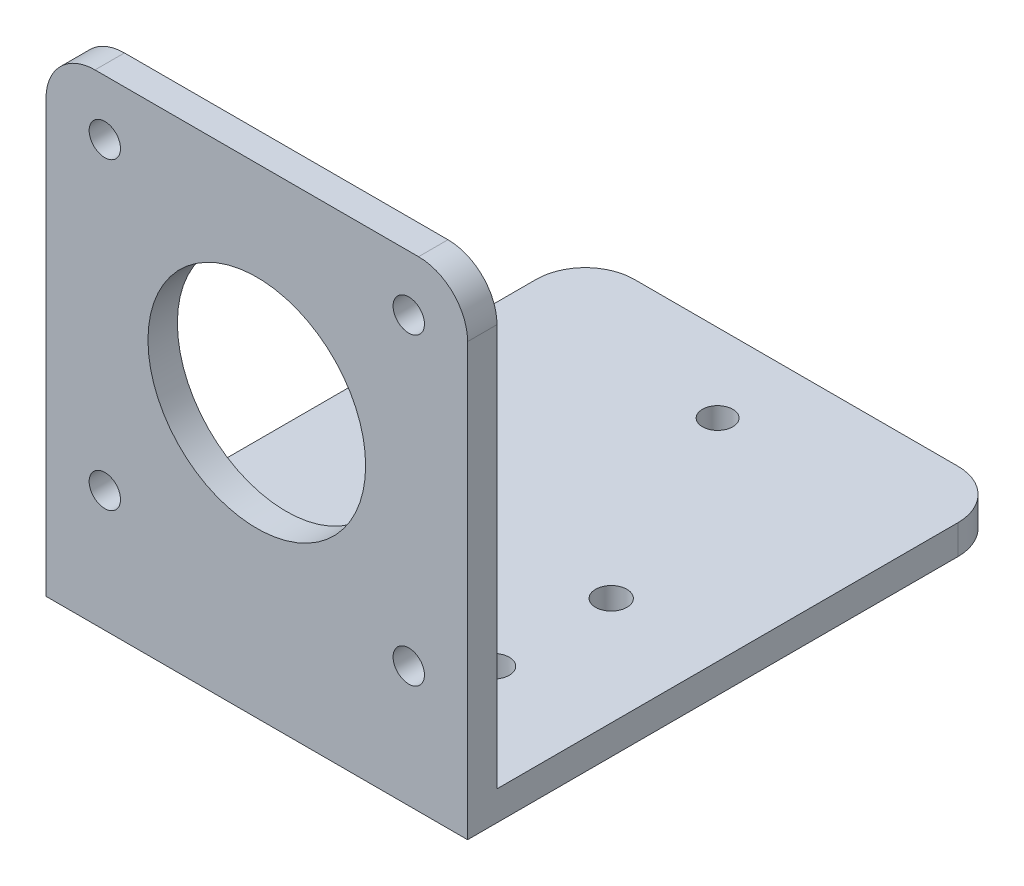
ISO-10303-21;
HEADER;
FILE_DESCRIPTION(('STEP AP214'),'2;1');
FILE_NAME('part.step','',(''),(''),'','','');
FILE_SCHEMA(('AUTOMOTIVE_DESIGN { 1 0 10303 214 1 1 1 1 }'));
ENDSEC;
DATA;
#1=APPLICATION_CONTEXT('core data for automotive mechanical design processes');
#2=APPLICATION_PROTOCOL_DEFINITION('international standard','automotive_design',2000,#1);
#3=PRODUCT_CONTEXT('',#1,'mechanical');
#4=PRODUCT('Part','Part','',(#3));
#5=PRODUCT_RELATED_PRODUCT_CATEGORY('part','',(#4));
#6=PRODUCT_DEFINITION_FORMATION('','',#4);
#7=PRODUCT_DEFINITION_CONTEXT('part definition',#1,'design');
#8=PRODUCT_DEFINITION('design','',#6,#7);
#9=PRODUCT_DEFINITION_SHAPE('','',#8);
#10=(LENGTH_UNIT() NAMED_UNIT(*) SI_UNIT(.MILLI.,.METRE.));
#11=(NAMED_UNIT(*) PLANE_ANGLE_UNIT() SI_UNIT($,.RADIAN.));
#12=(NAMED_UNIT(*) SI_UNIT($,.STERADIAN.) SOLID_ANGLE_UNIT());
#13=UNCERTAINTY_MEASURE_WITH_UNIT(LENGTH_MEASURE(1.E-05),#10,'distance_accuracy_value','');
#14=(GEOMETRIC_REPRESENTATION_CONTEXT(3) GLOBAL_UNCERTAINTY_ASSIGNED_CONTEXT((#13)) GLOBAL_UNIT_ASSIGNED_CONTEXT((#10,
#11,#12)) REPRESENTATION_CONTEXT('',''));
#15=CARTESIAN_POINT('',(0.,0.,0.));
#16=DIRECTION('',(0.,0.,1.));
#17=DIRECTION('',(1.,0.,0.));
#18=AXIS2_PLACEMENT_3D('',#15,#16,#17);
#19=CARTESIAN_POINT('',(0.,0.,0.));
#20=DIRECTION('',(0.,0.,1.));
#21=DIRECTION('',(1.,0.,0.));
#22=AXIS2_PLACEMENT_3D('',#19,#20,#21);
#23=PLANE('',#22);
#24=CARTESIAN_POINT('',(37.,-5.65,0.));
#25=DIRECTION('',(0.,0.,-1.));
#26=DIRECTION('',(-1.,0.,0.));
#27=AXIS2_PLACEMENT_3D('',#24,#25,#26);
#28=CIRCLE('',#27,1.6);
#29=CARTESIAN_POINT('',(35.4,-5.65,0.));
#30=VERTEX_POINT('',#29);
#31=EDGE_CURVE('E165',#30,#30,#28,.T.);
#32=ORIENTED_EDGE('',*,*,#31,.F.);
#33=EDGE_LOOP('',(#32));
#34=FACE_BOUND('',#33,.T.);
#35=CARTESIAN_POINT('',(5.99999999999999,-5.65,0.));
#36=DIRECTION('',(0.,0.,-1.));
#37=DIRECTION('',(1.,0.,0.));
#38=AXIS2_PLACEMENT_3D('',#35,#36,#37);
#39=CIRCLE('',#38,1.6);
#40=CARTESIAN_POINT('',(7.59999999999999,-5.65,0.));
#41=VERTEX_POINT('',#40);
#42=EDGE_CURVE('E161',#41,#41,#39,.T.);
#43=ORIENTED_EDGE('',*,*,#42,.F.);
#44=EDGE_LOOP('',(#43));
#45=FACE_BOUND('',#44,.T.);
#46=CARTESIAN_POINT('',(21.5,-21.15,0.));
#47=DIRECTION('',(0.,0.,-1.));
#48=DIRECTION('',(-1.,0.,0.));
#49=AXIS2_PLACEMENT_3D('',#46,#47,#48);
#50=CIRCLE('',#49,11.1);
#51=CARTESIAN_POINT('',(10.4,-21.15,0.));
#52=VERTEX_POINT('',#51);
#53=EDGE_CURVE('E166',#52,#52,#50,.T.);
#54=ORIENTED_EDGE('',*,*,#53,.F.);
#55=EDGE_LOOP('',(#54));
#56=FACE_BOUND('',#55,.T.);
#57=CARTESIAN_POINT('',(5.99999999999999,-36.65,0.));
#58=DIRECTION('',(0.,0.,-1.));
#59=DIRECTION('',(-1.,0.,0.));
#60=AXIS2_PLACEMENT_3D('',#57,#58,#59);
#61=CIRCLE('',#60,1.59999999999999);
#62=CARTESIAN_POINT('',(4.4,-36.65,0.));
#63=VERTEX_POINT('',#62);
#64=EDGE_CURVE('E170',#63,#63,#61,.T.);
#65=ORIENTED_EDGE('',*,*,#64,.F.);
#66=EDGE_LOOP('',(#65));
#67=FACE_BOUND('',#66,.T.);
#68=CARTESIAN_POINT('',(37.,-36.65,0.));
#69=DIRECTION('',(0.,0.,-1.));
#70=DIRECTION('',(1.,0.,0.));
#71=AXIS2_PLACEMENT_3D('',#68,#69,#70);
#72=CIRCLE('',#71,1.60000000000001);
#73=CARTESIAN_POINT('',(38.6,-36.65,0.));
#74=VERTEX_POINT('',#73);
#75=EDGE_CURVE('E160',#74,#74,#72,.T.);
#76=ORIENTED_EDGE('',*,*,#75,.F.);
#77=EDGE_LOOP('',(#76));
#78=FACE_BOUND('',#77,.T.);
#79=DIRECTION('',(0.,-1.,0.));
#80=VECTOR('',#79,1.);
#81=CARTESIAN_POINT('',(0.,0.,0.));
#82=LINE('',#81,#80);
#83=CARTESIAN_POINT('',(0.,-5.,0.));
#84=VERTEX_POINT('',#83);
#85=CARTESIAN_POINT('',(0.,-46.,0.));
#86=VERTEX_POINT('',#85);
#87=EDGE_CURVE('E140',#84,#86,#82,.T.);
#88=ORIENTED_EDGE('',*,*,#87,.F.);
#89=CARTESIAN_POINT('',(5.,-5.,0.));
#90=DIRECTION('',(0.,0.,1.));
#91=DIRECTION('',(1.,0.,0.));
#92=AXIS2_PLACEMENT_3D('',#89,#90,#91);
#93=CIRCLE('',#92,5.);
#94=CARTESIAN_POINT('',(5.,0.,0.));
#95=VERTEX_POINT('',#94);
#96=EDGE_CURVE('E257',#84,#95,#93,.F.);
#97=ORIENTED_EDGE('',*,*,#96,.T.);
#98=DIRECTION('',(-1.,0.,0.));
#99=VECTOR('',#98,1.);
#100=CARTESIAN_POINT('',(0.,0.,0.));
#101=LINE('',#100,#99);
#102=CARTESIAN_POINT('',(38.,0.,0.));
#103=VERTEX_POINT('',#102);
#104=EDGE_CURVE('E139',#103,#95,#101,.T.);
#105=ORIENTED_EDGE('',*,*,#104,.F.);
#106=CARTESIAN_POINT('',(38.,-5.,0.));
#107=DIRECTION('',(0.,0.,1.));
#108=DIRECTION('',(1.,0.,0.));
#109=AXIS2_PLACEMENT_3D('',#106,#107,#108);
#110=CIRCLE('',#109,5.);
#111=CARTESIAN_POINT('',(43.,-5.,0.));
#112=VERTEX_POINT('',#111);
#113=EDGE_CURVE('E137',#103,#112,#110,.F.);
#114=ORIENTED_EDGE('',*,*,#113,.T.);
#115=DIRECTION('',(0.,1.,0.));
#116=VECTOR('',#115,1.);
#117=CARTESIAN_POINT('',(43.,0.,0.));
#118=LINE('',#117,#116);
#119=CARTESIAN_POINT('',(43.,-46.,0.));
#120=VERTEX_POINT('',#119);
#121=EDGE_CURVE('E121',#120,#112,#118,.T.);
#122=ORIENTED_EDGE('',*,*,#121,.F.);
#123=DIRECTION('',(1.,0.,0.));
#124=VECTOR('',#123,1.);
#125=CARTESIAN_POINT('',(43.,-46.,0.));
#126=LINE('',#125,#124);
#127=EDGE_CURVE('E135',#86,#120,#126,.T.);
#128=ORIENTED_EDGE('',*,*,#127,.F.);
#129=EDGE_LOOP('',(#88,#97,#105,#114,#122,#128));
#130=FACE_BOUND('',#129,.T.);
#131=ADVANCED_FACE('F39',(#34,#45,#56,#67,#78,#130),#23,.F.);
#132=CARTESIAN_POINT('',(0.,0.,3.));
#133=DIRECTION('',(1.,0.,0.));
#134=DIRECTION('',(0.,1.,0.));
#135=AXIS2_PLACEMENT_3D('',#132,#133,#134);
#136=PLANE('',#135);
#137=DIRECTION('',(0.,0.,1.));
#138=VECTOR('',#137,1.);
#139=CARTESIAN_POINT('',(0.,-46.,-52.));
#140=LINE('',#139,#138);
#141=CARTESIAN_POINT('',(0.,-46.,-47.));
#142=VERTEX_POINT('',#141);
#143=EDGE_CURVE('E129',#142,#86,#140,.T.);
#144=ORIENTED_EDGE('',*,*,#143,.F.);
#145=DIRECTION('',(0.,1.,0.));
#146=VECTOR('',#145,1.);
#147=CARTESIAN_POINT('',(0.,0.,-47.));
#148=LINE('',#147,#146);
#149=CARTESIAN_POINT('',(0.,-49.,-47.));
#150=VERTEX_POINT('',#149);
#151=EDGE_CURVE('E252',#142,#150,#148,.F.);
#152=ORIENTED_EDGE('',*,*,#151,.T.);
#153=DIRECTION('',(0.,0.,-1.));
#154=VECTOR('',#153,1.);
#155=CARTESIAN_POINT('',(0.,-49.,3.));
#156=LINE('',#155,#154);
#157=CARTESIAN_POINT('',(0.,-49.,3.));
#158=VERTEX_POINT('',#157);
#159=EDGE_CURVE('E219',#158,#150,#156,.T.);
#160=ORIENTED_EDGE('',*,*,#159,.F.);
#161=DIRECTION('',(0.,-1.,0.));
#162=VECTOR('',#161,1.);
#163=CARTESIAN_POINT('',(0.,0.,3.));
#164=LINE('',#163,#162);
#165=CARTESIAN_POINT('',(0.,-5.,3.));
#166=VERTEX_POINT('',#165);
#167=EDGE_CURVE('E200',#166,#158,#164,.T.);
#168=ORIENTED_EDGE('',*,*,#167,.F.);
#169=DIRECTION('',(0.,0.,-1.));
#170=VECTOR('',#169,1.);
#171=CARTESIAN_POINT('',(0.,-5.,3.));
#172=LINE('',#171,#170);
#173=EDGE_CURVE('E248',#166,#84,#172,.T.);
#174=ORIENTED_EDGE('',*,*,#173,.T.);
#175=ORIENTED_EDGE('',*,*,#87,.T.);
#176=EDGE_LOOP('',(#144,#152,#160,#168,#174,#175));
#177=FACE_BOUND('',#176,.T.);
#178=ADVANCED_FACE('F291',(#177),#136,.F.);
#179=CARTESIAN_POINT('',(0.,-49.,3.));
#180=DIRECTION('',(0.,1.,0.));
#181=DIRECTION('',(0.,0.,1.));
#182=AXIS2_PLACEMENT_3D('',#179,#180,#181);
#183=PLANE('',#182);
#184=CARTESIAN_POINT('',(11.,-49.,-22.65));
#185=DIRECTION('',(0.,1.,0.));
#186=DIRECTION('',(0.,0.,1.));
#187=AXIS2_PLACEMENT_3D('',#184,#185,#186);
#188=CIRCLE('',#187,1.6);
#189=CARTESIAN_POINT('',(11.,-49.,-21.05));
#190=VERTEX_POINT('',#189);
#191=EDGE_CURVE('E147',#190,#190,#188,.T.);
#192=ORIENTED_EDGE('',*,*,#191,.T.);
#193=EDGE_LOOP('',(#192));
#194=FACE_BOUND('',#193,.T.);
#195=CARTESIAN_POINT('',(32.,-49.,-10.65));
#196=DIRECTION('',(0.,1.,0.));
#197=DIRECTION('',(0.,0.,1.));
#198=AXIS2_PLACEMENT_3D('',#195,#196,#197);
#199=CIRCLE('',#198,1.6);
#200=CARTESIAN_POINT('',(32.,-49.,-9.05));
#201=VERTEX_POINT('',#200);
#202=EDGE_CURVE('E154',#201,#201,#199,.T.);
#203=ORIENTED_EDGE('',*,*,#202,.T.);
#204=EDGE_LOOP('',(#203));
#205=FACE_BOUND('',#204,.T.);
#206=CARTESIAN_POINT('',(32.,-49.,-22.65));
#207=DIRECTION('',(0.,1.,0.));
#208=DIRECTION('',(0.,0.,1.));
#209=AXIS2_PLACEMENT_3D('',#206,#207,#208);
#210=CIRCLE('',#209,1.6);
#211=CARTESIAN_POINT('',(32.,-49.,-21.05));
#212=VERTEX_POINT('',#211);
#213=EDGE_CURVE('E333',#212,#212,#210,.T.);
#214=ORIENTED_EDGE('',*,*,#213,.T.);
#215=EDGE_LOOP('',(#214));
#216=FACE_BOUND('',#215,.T.);
#217=CARTESIAN_POINT('',(21.5,-49.,-44.));
#218=DIRECTION('',(0.,1.,0.));
#219=DIRECTION('',(0.,0.,1.));
#220=AXIS2_PLACEMENT_3D('',#217,#218,#219);
#221=CIRCLE('',#220,1.55);
#222=CARTESIAN_POINT('',(21.5,-49.,-42.45));
#223=VERTEX_POINT('',#222);
#224=EDGE_CURVE('E337',#223,#223,#221,.T.);
#225=ORIENTED_EDGE('',*,*,#224,.T.);
#226=EDGE_LOOP('',(#225));
#227=FACE_BOUND('',#226,.T.);
#228=CARTESIAN_POINT('',(11.,-49.,-10.65));
#229=DIRECTION('',(0.,1.,0.));
#230=DIRECTION('',(0.,0.,1.));
#231=AXIS2_PLACEMENT_3D('',#228,#229,#230);
#232=CIRCLE('',#231,1.6);
#233=CARTESIAN_POINT('',(11.,-49.,-9.05));
#234=VERTEX_POINT('',#233);
#235=EDGE_CURVE('E340',#234,#234,#232,.T.);
#236=ORIENTED_EDGE('',*,*,#235,.T.);
#237=EDGE_LOOP('',(#236));
#238=FACE_BOUND('',#237,.T.);
#239=DIRECTION('',(-1.,0.,0.));
#240=VECTOR('',#239,1.);
#241=CARTESIAN_POINT('',(43.,-49.,-52.));
#242=LINE('',#241,#240);
#243=CARTESIAN_POINT('',(38.,-49.,-52.));
#244=VERTEX_POINT('',#243);
#245=CARTESIAN_POINT('',(5.00000000000001,-49.,-52.));
#246=VERTEX_POINT('',#245);
#247=EDGE_CURVE('E146',#244,#246,#242,.T.);
#248=ORIENTED_EDGE('',*,*,#247,.F.);
#249=CARTESIAN_POINT('',(38.,-49.,-47.));
#250=DIRECTION('',(0.,1.,0.));
#251=DIRECTION('',(0.,0.,1.));
#252=AXIS2_PLACEMENT_3D('',#249,#250,#251);
#253=CIRCLE('',#252,5.);
#254=CARTESIAN_POINT('',(43.,-49.,-47.));
#255=VERTEX_POINT('',#254);
#256=EDGE_CURVE('E234',#244,#255,#253,.F.);
#257=ORIENTED_EDGE('',*,*,#256,.T.);
#258=DIRECTION('',(0.,0.,-1.));
#259=VECTOR('',#258,1.);
#260=CARTESIAN_POINT('',(43.,-49.,3.));
#261=LINE('',#260,#259);
#262=CARTESIAN_POINT('',(43.,-49.,3.));
#263=VERTEX_POINT('',#262);
#264=EDGE_CURVE('E212',#263,#255,#261,.T.);
#265=ORIENTED_EDGE('',*,*,#264,.F.);
#266=DIRECTION('',(1.,0.,0.));
#267=VECTOR('',#266,1.);
#268=CARTESIAN_POINT('',(0.,-49.,3.));
#269=LINE('',#268,#267);
#270=EDGE_CURVE('E203',#158,#263,#269,.T.);
#271=ORIENTED_EDGE('',*,*,#270,.F.);
#272=ORIENTED_EDGE('',*,*,#159,.T.);
#273=CARTESIAN_POINT('',(5.00000000000001,-49.,-47.));
#274=DIRECTION('',(0.,1.,0.));
#275=DIRECTION('',(0.,0.,1.));
#276=AXIS2_PLACEMENT_3D('',#273,#274,#275);
#277=CIRCLE('',#276,5.);
#278=EDGE_CURVE('E231',#150,#246,#277,.F.);
#279=ORIENTED_EDGE('',*,*,#278,.T.);
#280=EDGE_LOOP('',(#248,#257,#265,#271,#272,#279));
#281=FACE_BOUND('',#280,.T.);
#282=ADVANCED_FACE('F278',(#194,#205,#216,#227,#238,#281),#183,.F.);
#283=CARTESIAN_POINT('',(43.,0.,3.));
#284=DIRECTION('',(-1.,0.,0.));
#285=DIRECTION('',(0.,-1.,0.));
#286=AXIS2_PLACEMENT_3D('',#283,#284,#285);
#287=PLANE('',#286);
#288=ORIENTED_EDGE('',*,*,#264,.T.);
#289=DIRECTION('',(0.,-1.,0.));
#290=VECTOR('',#289,1.);
#291=CARTESIAN_POINT('',(43.,0.,-47.));
#292=LINE('',#291,#290);
#293=CARTESIAN_POINT('',(43.,-46.,-47.));
#294=VERTEX_POINT('',#293);
#295=EDGE_CURVE('E124',#255,#294,#292,.F.);
#296=ORIENTED_EDGE('',*,*,#295,.T.);
#297=DIRECTION('',(0.,0.,1.));
#298=VECTOR('',#297,1.);
#299=CARTESIAN_POINT('',(43.,-46.,-52.));
#300=LINE('',#299,#298);
#301=EDGE_CURVE('E117',#294,#120,#300,.T.);
#302=ORIENTED_EDGE('',*,*,#301,.T.);
#303=ORIENTED_EDGE('',*,*,#121,.T.);
#304=DIRECTION('',(0.,0.,-1.));
#305=VECTOR('',#304,1.);
#306=CARTESIAN_POINT('',(43.,-5.,3.));
#307=LINE('',#306,#305);
#308=CARTESIAN_POINT('',(43.,-5.,3.));
#309=VERTEX_POINT('',#308);
#310=EDGE_CURVE('E237',#112,#309,#307,.F.);
#311=ORIENTED_EDGE('',*,*,#310,.T.);
#312=DIRECTION('',(0.,1.,0.));
#313=VECTOR('',#312,1.);
#314=CARTESIAN_POINT('',(43.,0.,3.));
#315=LINE('',#314,#313);
#316=EDGE_CURVE('E206',#263,#309,#315,.T.);
#317=ORIENTED_EDGE('',*,*,#316,.F.);
#318=EDGE_LOOP('',(#288,#296,#302,#303,#311,#317));
#319=FACE_BOUND('',#318,.T.);
#320=ADVANCED_FACE('F120',(#319),#287,.F.);
#321=CARTESIAN_POINT('',(0.,0.,3.));
#322=DIRECTION('',(0.,-1.,0.));
#323=DIRECTION('',(0.,0.,-1.));
#324=AXIS2_PLACEMENT_3D('',#321,#322,#323);
#325=PLANE('',#324);
#326=ORIENTED_EDGE('',*,*,#104,.T.);
#327=DIRECTION('',(0.,0.,-1.));
#328=VECTOR('',#327,1.);
#329=CARTESIAN_POINT('',(5.,0.,3.));
#330=LINE('',#329,#328);
#331=CARTESIAN_POINT('',(5.,0.,3.));
#332=VERTEX_POINT('',#331);
#333=EDGE_CURVE('E55',#95,#332,#330,.F.);
#334=ORIENTED_EDGE('',*,*,#333,.T.);
#335=DIRECTION('',(-1.,0.,0.));
#336=VECTOR('',#335,1.);
#337=CARTESIAN_POINT('',(0.,0.,3.));
#338=LINE('',#337,#336);
#339=CARTESIAN_POINT('',(38.,0.,3.));
#340=VERTEX_POINT('',#339);
#341=EDGE_CURVE('E209',#340,#332,#338,.T.);
#342=ORIENTED_EDGE('',*,*,#341,.F.);
#343=DIRECTION('',(0.,0.,-1.));
#344=VECTOR('',#343,1.);
#345=CARTESIAN_POINT('',(38.,0.,3.));
#346=LINE('',#345,#344);
#347=EDGE_CURVE('E260',#340,#103,#346,.T.);
#348=ORIENTED_EDGE('',*,*,#347,.T.);
#349=EDGE_LOOP('',(#326,#334,#342,#348));
#350=FACE_BOUND('',#349,.T.);
#351=ADVANCED_FACE('F284',(#350),#325,.F.);
#352=CARTESIAN_POINT('',(0.,0.,3.));
#353=DIRECTION('',(0.,0.,1.));
#354=DIRECTION('',(1.,0.,0.));
#355=AXIS2_PLACEMENT_3D('',#352,#353,#354);
#356=PLANE('',#355);
#357=CARTESIAN_POINT('',(37.,-36.65,3.));
#358=DIRECTION('',(0.,0.,1.));
#359=DIRECTION('',(1.,0.,0.));
#360=AXIS2_PLACEMENT_3D('',#357,#358,#359);
#361=CIRCLE('',#360,1.60000000000001);
#362=CARTESIAN_POINT('',(38.6,-36.65,3.));
#363=VERTEX_POINT('',#362);
#364=EDGE_CURVE('E196',#363,#363,#361,.T.);
#365=ORIENTED_EDGE('',*,*,#364,.F.);
#366=EDGE_LOOP('',(#365));
#367=FACE_BOUND('',#366,.T.);
#368=CARTESIAN_POINT('',(5.99999999999999,-36.65,3.));
#369=DIRECTION('',(0.,0.,1.));
#370=DIRECTION('',(1.,0.,0.));
#371=AXIS2_PLACEMENT_3D('',#368,#369,#370);
#372=CIRCLE('',#371,1.59999999999999);
#373=CARTESIAN_POINT('',(7.59999999999999,-36.65,3.));
#374=VERTEX_POINT('',#373);
#375=EDGE_CURVE('E192',#374,#374,#372,.T.);
#376=ORIENTED_EDGE('',*,*,#375,.F.);
#377=EDGE_LOOP('',(#376));
#378=FACE_BOUND('',#377,.T.);
#379=CARTESIAN_POINT('',(21.5,-21.15,3.));
#380=DIRECTION('',(0.,0.,1.));
#381=DIRECTION('',(1.,0.,0.));
#382=AXIS2_PLACEMENT_3D('',#379,#380,#381);
#383=CIRCLE('',#382,11.1);
#384=CARTESIAN_POINT('',(32.6,-21.15,3.));
#385=VERTEX_POINT('',#384);
#386=EDGE_CURVE('E188',#385,#385,#383,.T.);
#387=ORIENTED_EDGE('',*,*,#386,.F.);
#388=EDGE_LOOP('',(#387));
#389=FACE_BOUND('',#388,.T.);
#390=CARTESIAN_POINT('',(5.99999999999999,-5.65,3.));
#391=DIRECTION('',(0.,0.,1.));
#392=DIRECTION('',(1.,0.,0.));
#393=AXIS2_PLACEMENT_3D('',#390,#391,#392);
#394=CIRCLE('',#393,1.6);
#395=CARTESIAN_POINT('',(7.59999999999999,-5.65,3.));
#396=VERTEX_POINT('',#395);
#397=EDGE_CURVE('E184',#396,#396,#394,.T.);
#398=ORIENTED_EDGE('',*,*,#397,.F.);
#399=EDGE_LOOP('',(#398));
#400=FACE_BOUND('',#399,.T.);
#401=CARTESIAN_POINT('',(37.,-5.65,3.));
#402=DIRECTION('',(0.,0.,1.));
#403=DIRECTION('',(1.,0.,0.));
#404=AXIS2_PLACEMENT_3D('',#401,#402,#403);
#405=CIRCLE('',#404,1.6);
#406=CARTESIAN_POINT('',(38.6,-5.65,3.));
#407=VERTEX_POINT('',#406);
#408=EDGE_CURVE('E180',#407,#407,#405,.T.);
#409=ORIENTED_EDGE('',*,*,#408,.F.);
#410=EDGE_LOOP('',(#409));
#411=FACE_BOUND('',#410,.T.);
#412=ORIENTED_EDGE('',*,*,#341,.T.);
#413=CARTESIAN_POINT('',(5.,-5.,3.));
#414=DIRECTION('',(0.,0.,1.));
#415=DIRECTION('',(1.,0.,0.));
#416=AXIS2_PLACEMENT_3D('',#413,#414,#415);
#417=CIRCLE('',#416,5.);
#418=EDGE_CURVE('E11',#332,#166,#417,.T.);
#419=ORIENTED_EDGE('',*,*,#418,.T.);
#420=ORIENTED_EDGE('',*,*,#167,.T.);
#421=ORIENTED_EDGE('',*,*,#270,.T.);
#422=ORIENTED_EDGE('',*,*,#316,.T.);
#423=CARTESIAN_POINT('',(38.,-5.,3.));
#424=DIRECTION('',(0.,0.,1.));
#425=DIRECTION('',(1.,0.,0.));
#426=AXIS2_PLACEMENT_3D('',#423,#424,#425);
#427=CIRCLE('',#426,5.);
#428=EDGE_CURVE('E48',#309,#340,#427,.T.);
#429=ORIENTED_EDGE('',*,*,#428,.T.);
#430=EDGE_LOOP('',(#412,#419,#420,#421,#422,#429));
#431=FACE_BOUND('',#430,.T.);
#432=ADVANCED_FACE('F281',(#367,#378,#389,#400,#411,#431),#356,.T.);
#433=CARTESIAN_POINT('',(37.,-5.65,45.));
#434=DIRECTION('',(0.,0.,-1.));
#435=DIRECTION('',(-1.,0.,0.));
#436=AXIS2_PLACEMENT_3D('',#433,#434,#435);
#437=CYLINDRICAL_SURFACE('',#436,1.6);
#438=ORIENTED_EDGE('',*,*,#408,.T.);
#439=EDGE_LOOP('',(#438));
#440=FACE_BOUND('',#439,.T.);
#441=ORIENTED_EDGE('',*,*,#31,.T.);
#442=EDGE_LOOP('',(#441));
#443=FACE_BOUND('',#442,.T.);
#444=ADVANCED_FACE('F403',(#440,#443),#437,.F.);
#445=CARTESIAN_POINT('',(5.99999999999999,-5.65,45.));
#446=DIRECTION('',(0.,0.,-1.));
#447=DIRECTION('',(-1.,0.,0.));
#448=AXIS2_PLACEMENT_3D('',#445,#446,#447);
#449=CYLINDRICAL_SURFACE('',#448,1.6);
#450=ORIENTED_EDGE('',*,*,#397,.T.);
#451=EDGE_LOOP('',(#450));
#452=FACE_BOUND('',#451,.T.);
#453=ORIENTED_EDGE('',*,*,#42,.T.);
#454=EDGE_LOOP('',(#453));
#455=FACE_BOUND('',#454,.T.);
#456=ADVANCED_FACE('F399',(#452,#455),#449,.F.);
#457=CARTESIAN_POINT('',(21.5,-21.15,45.));
#458=DIRECTION('',(0.,0.,-1.));
#459=DIRECTION('',(-1.,0.,0.));
#460=AXIS2_PLACEMENT_3D('',#457,#458,#459);
#461=CYLINDRICAL_SURFACE('',#460,11.1);
#462=ORIENTED_EDGE('',*,*,#386,.T.);
#463=EDGE_LOOP('',(#462));
#464=FACE_BOUND('',#463,.T.);
#465=ORIENTED_EDGE('',*,*,#53,.T.);
#466=EDGE_LOOP('',(#465));
#467=FACE_BOUND('',#466,.T.);
#468=ADVANCED_FACE('F402',(#464,#467),#461,.F.);
#469=CARTESIAN_POINT('',(5.99999999999999,-36.65,45.));
#470=DIRECTION('',(0.,0.,-1.));
#471=DIRECTION('',(-1.,0.,0.));
#472=AXIS2_PLACEMENT_3D('',#469,#470,#471);
#473=CYLINDRICAL_SURFACE('',#472,1.59999999999999);
#474=ORIENTED_EDGE('',*,*,#375,.T.);
#475=EDGE_LOOP('',(#474));
#476=FACE_BOUND('',#475,.T.);
#477=ORIENTED_EDGE('',*,*,#64,.T.);
#478=EDGE_LOOP('',(#477));
#479=FACE_BOUND('',#478,.T.);
#480=ADVANCED_FACE('F407',(#476,#479),#473,.F.);
#481=CARTESIAN_POINT('',(37.,-36.65,45.));
#482=DIRECTION('',(0.,0.,-1.));
#483=DIRECTION('',(-1.,0.,0.));
#484=AXIS2_PLACEMENT_3D('',#481,#482,#483);
#485=CYLINDRICAL_SURFACE('',#484,1.60000000000001);
#486=ORIENTED_EDGE('',*,*,#364,.T.);
#487=EDGE_LOOP('',(#486));
#488=FACE_BOUND('',#487,.T.);
#489=ORIENTED_EDGE('',*,*,#75,.T.);
#490=EDGE_LOOP('',(#489));
#491=FACE_BOUND('',#490,.T.);
#492=ADVANCED_FACE('F377',(#488,#491),#485,.F.);
#493=CARTESIAN_POINT('',(43.,-46.,-52.));
#494=DIRECTION('',(0.,-1.,0.));
#495=DIRECTION('',(0.,0.,-1.));
#496=AXIS2_PLACEMENT_3D('',#493,#494,#495);
#497=PLANE('',#496);
#498=CARTESIAN_POINT('',(11.,-46.,-22.65));
#499=DIRECTION('',(0.,1.,0.));
#500=DIRECTION('',(0.,0.,1.));
#501=AXIS2_PLACEMENT_3D('',#498,#499,#500);
#502=CIRCLE('',#501,1.6);
#503=CARTESIAN_POINT('',(11.,-46.,-21.05));
#504=VERTEX_POINT('',#503);
#505=EDGE_CURVE('E349',#504,#504,#502,.T.);
#506=ORIENTED_EDGE('',*,*,#505,.F.);
#507=EDGE_LOOP('',(#506));
#508=FACE_BOUND('',#507,.T.);
#509=CARTESIAN_POINT('',(32.,-46.,-10.65));
#510=DIRECTION('',(0.,1.,0.));
#511=DIRECTION('',(0.,0.,-1.));
#512=AXIS2_PLACEMENT_3D('',#509,#510,#511);
#513=CIRCLE('',#512,1.6);
#514=CARTESIAN_POINT('',(32.,-46.,-12.25));
#515=VERTEX_POINT('',#514);
#516=EDGE_CURVE('E356',#515,#515,#513,.T.);
#517=ORIENTED_EDGE('',*,*,#516,.F.);
#518=EDGE_LOOP('',(#517));
#519=FACE_BOUND('',#518,.T.);
#520=CARTESIAN_POINT('',(32.,-46.,-22.65));
#521=DIRECTION('',(0.,1.,0.));
#522=DIRECTION('',(0.,0.,-1.));
#523=AXIS2_PLACEMENT_3D('',#520,#521,#522);
#524=CIRCLE('',#523,1.6);
#525=CARTESIAN_POINT('',(32.,-46.,-24.25));
#526=VERTEX_POINT('',#525);
#527=EDGE_CURVE('E360',#526,#526,#524,.T.);
#528=ORIENTED_EDGE('',*,*,#527,.F.);
#529=EDGE_LOOP('',(#528));
#530=FACE_BOUND('',#529,.T.);
#531=CARTESIAN_POINT('',(21.5,-46.,-44.));
#532=DIRECTION('',(0.,1.,0.));
#533=DIRECTION('',(0.,0.,1.));
#534=AXIS2_PLACEMENT_3D('',#531,#532,#533);
#535=CIRCLE('',#534,1.55);
#536=CARTESIAN_POINT('',(21.5,-46.,-42.45));
#537=VERTEX_POINT('',#536);
#538=EDGE_CURVE('E364',#537,#537,#535,.T.);
#539=ORIENTED_EDGE('',*,*,#538,.F.);
#540=EDGE_LOOP('',(#539));
#541=FACE_BOUND('',#540,.T.);
#542=CARTESIAN_POINT('',(11.,-46.,-10.65));
#543=DIRECTION('',(0.,1.,0.));
#544=DIRECTION('',(0.,0.,1.));
#545=AXIS2_PLACEMENT_3D('',#542,#543,#544);
#546=CIRCLE('',#545,1.6);
#547=CARTESIAN_POINT('',(11.,-46.,-9.05));
#548=VERTEX_POINT('',#547);
#549=EDGE_CURVE('E343',#548,#548,#546,.T.);
#550=ORIENTED_EDGE('',*,*,#549,.F.);
#551=EDGE_LOOP('',(#550));
#552=FACE_BOUND('',#551,.T.);
#553=ORIENTED_EDGE('',*,*,#301,.F.);
#554=CARTESIAN_POINT('',(38.,-46.,-47.));
#555=DIRECTION('',(0.,-1.,0.));
#556=DIRECTION('',(0.,0.,-1.));
#557=AXIS2_PLACEMENT_3D('',#554,#555,#556);
#558=CIRCLE('',#557,5.);
#559=CARTESIAN_POINT('',(38.,-46.,-52.));
#560=VERTEX_POINT('',#559);
#561=EDGE_CURVE('E245',#294,#560,#558,.F.);
#562=ORIENTED_EDGE('',*,*,#561,.T.);
#563=DIRECTION('',(1.,0.,0.));
#564=VECTOR('',#563,1.);
#565=CARTESIAN_POINT('',(43.,-46.,-52.));
#566=LINE('',#565,#564);
#567=CARTESIAN_POINT('',(5.00000000000001,-46.,-52.));
#568=VERTEX_POINT('',#567);
#569=EDGE_CURVE('E130',#568,#560,#566,.T.);
#570=ORIENTED_EDGE('',*,*,#569,.F.);
#571=CARTESIAN_POINT('',(5.00000000000001,-46.,-47.));
#572=DIRECTION('',(0.,-1.,0.));
#573=DIRECTION('',(0.,0.,-1.));
#574=AXIS2_PLACEMENT_3D('',#571,#572,#573);
#575=CIRCLE('',#574,5.);
#576=EDGE_CURVE('E242',#568,#142,#575,.F.);
#577=ORIENTED_EDGE('',*,*,#576,.T.);
#578=ORIENTED_EDGE('',*,*,#143,.T.);
#579=ORIENTED_EDGE('',*,*,#127,.T.);
#580=EDGE_LOOP('',(#553,#562,#570,#577,#578,#579));
#581=FACE_BOUND('',#580,.T.);
#582=ADVANCED_FACE('F143',(#508,#519,#530,#541,#552,#581),#497,.F.);
#583=CARTESIAN_POINT('',(0.,0.,-52.));
#584=DIRECTION('',(0.,0.,1.));
#585=DIRECTION('',(1.,0.,0.));
#586=AXIS2_PLACEMENT_3D('',#583,#584,#585);
#587=PLANE('',#586);
#588=ORIENTED_EDGE('',*,*,#569,.T.);
#589=DIRECTION('',(0.,-1.,0.));
#590=VECTOR('',#589,1.);
#591=CARTESIAN_POINT('',(38.,0.,-52.));
#592=LINE('',#591,#590);
#593=EDGE_CURVE('E227',#560,#244,#592,.T.);
#594=ORIENTED_EDGE('',*,*,#593,.T.);
#595=ORIENTED_EDGE('',*,*,#247,.T.);
#596=DIRECTION('',(0.,1.,0.));
#597=VECTOR('',#596,1.);
#598=CARTESIAN_POINT('',(5.,0.,-52.));
#599=LINE('',#598,#597);
#600=EDGE_CURVE('E223',#246,#568,#599,.T.);
#601=ORIENTED_EDGE('',*,*,#600,.T.);
#602=EDGE_LOOP('',(#588,#594,#595,#601));
#603=FACE_BOUND('',#602,.T.);
#604=ADVANCED_FACE('F271',(#603),#587,.F.);
#605=CARTESIAN_POINT('',(11.,-91.,-10.65));
#606=DIRECTION('',(0.,1.,0.));
#607=DIRECTION('',(0.,0.,1.));
#608=AXIS2_PLACEMENT_3D('',#605,#606,#607);
#609=CYLINDRICAL_SURFACE('',#608,1.6);
#610=ORIENTED_EDGE('',*,*,#549,.T.);
#611=EDGE_LOOP('',(#610));
#612=FACE_BOUND('',#611,.T.);
#613=ORIENTED_EDGE('',*,*,#235,.F.);
#614=EDGE_LOOP('',(#613));
#615=FACE_BOUND('',#614,.T.);
#616=ADVANCED_FACE('F384',(#612,#615),#609,.F.);
#617=CARTESIAN_POINT('',(21.5,-91.,-44.));
#618=DIRECTION('',(0.,1.,0.));
#619=DIRECTION('',(0.,0.,1.));
#620=AXIS2_PLACEMENT_3D('',#617,#618,#619);
#621=CYLINDRICAL_SURFACE('',#620,1.55);
#622=ORIENTED_EDGE('',*,*,#538,.T.);
#623=EDGE_LOOP('',(#622));
#624=FACE_BOUND('',#623,.T.);
#625=ORIENTED_EDGE('',*,*,#224,.F.);
#626=EDGE_LOOP('',(#625));
#627=FACE_BOUND('',#626,.T.);
#628=ADVANCED_FACE('F386',(#624,#627),#621,.F.);
#629=CARTESIAN_POINT('',(32.,-91.,-22.65));
#630=DIRECTION('',(0.,1.,0.));
#631=DIRECTION('',(0.,0.,1.));
#632=AXIS2_PLACEMENT_3D('',#629,#630,#631);
#633=CYLINDRICAL_SURFACE('',#632,1.6);
#634=ORIENTED_EDGE('',*,*,#527,.T.);
#635=EDGE_LOOP('',(#634));
#636=FACE_BOUND('',#635,.T.);
#637=ORIENTED_EDGE('',*,*,#213,.F.);
#638=EDGE_LOOP('',(#637));
#639=FACE_BOUND('',#638,.T.);
#640=ADVANCED_FACE('F372',(#636,#639),#633,.F.);
#641=CARTESIAN_POINT('',(32.,-91.,-10.65));
#642=DIRECTION('',(0.,1.,0.));
#643=DIRECTION('',(0.,0.,1.));
#644=AXIS2_PLACEMENT_3D('',#641,#642,#643);
#645=CYLINDRICAL_SURFACE('',#644,1.6);
#646=ORIENTED_EDGE('',*,*,#516,.T.);
#647=EDGE_LOOP('',(#646));
#648=FACE_BOUND('',#647,.T.);
#649=ORIENTED_EDGE('',*,*,#202,.F.);
#650=EDGE_LOOP('',(#649));
#651=FACE_BOUND('',#650,.T.);
#652=ADVANCED_FACE('F396',(#648,#651),#645,.F.);
#653=CARTESIAN_POINT('',(11.,-91.,-22.65));
#654=DIRECTION('',(0.,1.,0.));
#655=DIRECTION('',(0.,0.,1.));
#656=AXIS2_PLACEMENT_3D('',#653,#654,#655);
#657=CYLINDRICAL_SURFACE('',#656,1.6);
#658=ORIENTED_EDGE('',*,*,#505,.T.);
#659=EDGE_LOOP('',(#658));
#660=FACE_BOUND('',#659,.T.);
#661=ORIENTED_EDGE('',*,*,#191,.F.);
#662=EDGE_LOOP('',(#661));
#663=FACE_BOUND('',#662,.T.);
#664=ADVANCED_FACE('F303',(#660,#663),#657,.F.);
#665=CARTESIAN_POINT('',(38.,0.,-47.));
#666=DIRECTION('',(0.,-1.,0.));
#667=DIRECTION('',(1.,0.,0.));
#668=AXIS2_PLACEMENT_3D('',#665,#666,#667);
#669=CYLINDRICAL_SURFACE('',#668,5.);
#670=ORIENTED_EDGE('',*,*,#561,.F.);
#671=ORIENTED_EDGE('',*,*,#295,.F.);
#672=ORIENTED_EDGE('',*,*,#256,.F.);
#673=ORIENTED_EDGE('',*,*,#593,.F.);
#674=EDGE_LOOP('',(#670,#671,#672,#673));
#675=FACE_BOUND('',#674,.T.);
#676=ADVANCED_FACE('F275',(#675),#669,.T.);
#677=CARTESIAN_POINT('',(5.,0.,-47.));
#678=DIRECTION('',(0.,1.,0.));
#679=DIRECTION('',(-1.,0.,0.));
#680=AXIS2_PLACEMENT_3D('',#677,#678,#679);
#681=CYLINDRICAL_SURFACE('',#680,5.);
#682=ORIENTED_EDGE('',*,*,#278,.F.);
#683=ORIENTED_EDGE('',*,*,#151,.F.);
#684=ORIENTED_EDGE('',*,*,#576,.F.);
#685=ORIENTED_EDGE('',*,*,#600,.F.);
#686=EDGE_LOOP('',(#682,#683,#684,#685));
#687=FACE_BOUND('',#686,.T.);
#688=ADVANCED_FACE('F296',(#687),#681,.T.);
#689=CARTESIAN_POINT('',(5.,-5.,3.));
#690=DIRECTION('',(0.,0.,-1.));
#691=DIRECTION('',(-1.,0.,0.));
#692=AXIS2_PLACEMENT_3D('',#689,#690,#691);
#693=CYLINDRICAL_SURFACE('',#692,5.);
#694=ORIENTED_EDGE('',*,*,#418,.F.);
#695=ORIENTED_EDGE('',*,*,#333,.F.);
#696=ORIENTED_EDGE('',*,*,#96,.F.);
#697=ORIENTED_EDGE('',*,*,#173,.F.);
#698=EDGE_LOOP('',(#694,#695,#696,#697));
#699=FACE_BOUND('',#698,.T.);
#700=ADVANCED_FACE('F288',(#699),#693,.T.);
#701=CARTESIAN_POINT('',(38.,-5.,3.));
#702=DIRECTION('',(0.,0.,-1.));
#703=DIRECTION('',(-1.,0.,0.));
#704=AXIS2_PLACEMENT_3D('',#701,#702,#703);
#705=CYLINDRICAL_SURFACE('',#704,5.);
#706=ORIENTED_EDGE('',*,*,#428,.F.);
#707=ORIENTED_EDGE('',*,*,#310,.F.);
#708=ORIENTED_EDGE('',*,*,#113,.F.);
#709=ORIENTED_EDGE('',*,*,#347,.F.);
#710=EDGE_LOOP('',(#706,#707,#708,#709));
#711=FACE_BOUND('',#710,.T.);
#712=ADVANCED_FACE('F41',(#711),#705,.T.);
#713=CLOSED_SHELL('',(#131,#178,#282,#320,#351,#432,#444,#456,#468,#480,#492,#582,#604,#616,
#628,#640,#652,#664,#676,#688,#700,#712));
#714=MANIFOLD_SOLID_BREP('B2',#713);
#715=ADVANCED_BREP_SHAPE_REPRESENTATION('',(#18,#714),#14);
#716=SHAPE_DEFINITION_REPRESENTATION(#9,#715);
ENDSEC;
END-ISO-10303-21;
